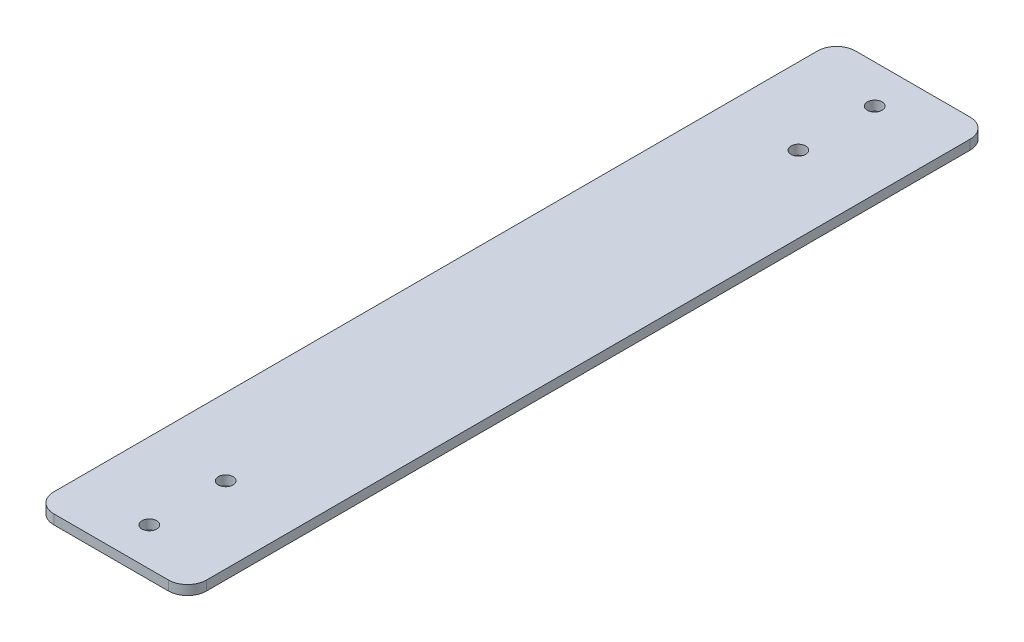
ISO-10303-21;
HEADER;
FILE_DESCRIPTION(('STEP AP214'),'2;1');
FILE_NAME('part.step','',(''),(''),'','','');
FILE_SCHEMA(('AUTOMOTIVE_DESIGN { 1 0 10303 214 1 1 1 1 }'));
ENDSEC;
DATA;
#1=APPLICATION_CONTEXT('core data for automotive mechanical design processes');
#2=APPLICATION_PROTOCOL_DEFINITION('international standard','automotive_design',2000,#1);
#3=PRODUCT_CONTEXT('',#1,'mechanical');
#4=PRODUCT('Part','Part','',(#3));
#5=PRODUCT_RELATED_PRODUCT_CATEGORY('part','',(#4));
#6=PRODUCT_DEFINITION_FORMATION('','',#4);
#7=PRODUCT_DEFINITION_CONTEXT('part definition',#1,'design');
#8=PRODUCT_DEFINITION('design','',#6,#7);
#9=PRODUCT_DEFINITION_SHAPE('','',#8);
#10=(LENGTH_UNIT() NAMED_UNIT(*) SI_UNIT(.MILLI.,.METRE.));
#11=(NAMED_UNIT(*) PLANE_ANGLE_UNIT() SI_UNIT($,.RADIAN.));
#12=(NAMED_UNIT(*) SI_UNIT($,.STERADIAN.) SOLID_ANGLE_UNIT());
#13=UNCERTAINTY_MEASURE_WITH_UNIT(LENGTH_MEASURE(1.E-05),#10,'distance_accuracy_value','');
#14=(GEOMETRIC_REPRESENTATION_CONTEXT(3) GLOBAL_UNCERTAINTY_ASSIGNED_CONTEXT((#13)) GLOBAL_UNIT_ASSIGNED_CONTEXT((#10,
#11,#12)) REPRESENTATION_CONTEXT('',''));
#15=CARTESIAN_POINT('',(0.,0.,0.));
#16=DIRECTION('',(0.,0.,1.));
#17=DIRECTION('',(1.,0.,0.));
#18=AXIS2_PLACEMENT_3D('',#15,#16,#17);
#19=CARTESIAN_POINT('',(-25.4,-3.18262,-133.35));
#20=DIRECTION('',(0.,1.,0.));
#21=DIRECTION('',(0.,0.,1.));
#22=AXIS2_PLACEMENT_3D('',#19,#20,#21);
#23=PLANE('',#22);
#24=CARTESIAN_POINT('',(0.,-3.18262,-120.65));
#25=DIRECTION('',(0.,1.,0.));
#26=DIRECTION('',(0.,0.,1.));
#27=AXIS2_PLACEMENT_3D('',#24,#25,#26);
#28=CIRCLE('',#27,2.4384);
#29=CARTESIAN_POINT('',(0.,-3.18262,-118.2116));
#30=VERTEX_POINT('',#29);
#31=EDGE_CURVE('E140',#30,#30,#28,.T.);
#32=ORIENTED_EDGE('',*,*,#31,.T.);
#33=EDGE_LOOP('',(#32));
#34=FACE_BOUND('',#33,.T.);
#35=CARTESIAN_POINT('',(0.,-3.18262,95.25));
#36=DIRECTION('',(0.,-1.,0.));
#37=DIRECTION('',(0.,0.,-1.));
#38=AXIS2_PLACEMENT_3D('',#35,#36,#37);
#39=CIRCLE('',#38,2.4384);
#40=CARTESIAN_POINT('',(0.,-3.18262,92.8116));
#41=VERTEX_POINT('',#40);
#42=EDGE_CURVE('E143',#41,#41,#39,.F.);
#43=ORIENTED_EDGE('',*,*,#42,.T.);
#44=EDGE_LOOP('',(#43));
#45=FACE_BOUND('',#44,.T.);
#46=CARTESIAN_POINT('',(0.,-3.18262,120.65));
#47=DIRECTION('',(0.,-1.,0.));
#48=DIRECTION('',(0.,0.,-1.));
#49=AXIS2_PLACEMENT_3D('',#46,#47,#48);
#50=CIRCLE('',#49,2.4384);
#51=CARTESIAN_POINT('',(0.,-3.18262,118.2116));
#52=VERTEX_POINT('',#51);
#53=EDGE_CURVE('E146',#52,#52,#50,.F.);
#54=ORIENTED_EDGE('',*,*,#53,.T.);
#55=EDGE_LOOP('',(#54));
#56=FACE_BOUND('',#55,.T.);
#57=CARTESIAN_POINT('',(0.,-3.18262,-95.25));
#58=DIRECTION('',(0.,1.,0.));
#59=DIRECTION('',(0.,0.,1.));
#60=AXIS2_PLACEMENT_3D('',#57,#58,#59);
#61=CIRCLE('',#60,2.4384);
#62=CARTESIAN_POINT('',(0.,-3.18262,-92.8116));
#63=VERTEX_POINT('',#62);
#64=EDGE_CURVE('E149',#63,#63,#61,.T.);
#65=ORIENTED_EDGE('',*,*,#64,.T.);
#66=EDGE_LOOP('',(#65));
#67=FACE_BOUND('',#66,.T.);
#68=CARTESIAN_POINT('',(19.05,-3.18262,127.));
#69=DIRECTION('',(0.,1.,0.));
#70=DIRECTION('',(0.,0.,1.));
#71=AXIS2_PLACEMENT_3D('',#68,#69,#70);
#72=CIRCLE('',#71,6.35);
#73=CARTESIAN_POINT('',(19.05,-3.18262,133.35));
#74=VERTEX_POINT('',#73);
#75=CARTESIAN_POINT('',(25.4,-3.18262,127.));
#76=VERTEX_POINT('',#75);
#77=EDGE_CURVE('E113',#74,#76,#72,.T.);
#78=ORIENTED_EDGE('',*,*,#77,.F.);
#79=DIRECTION('',(1.,0.,0.));
#80=VECTOR('',#79,1.);
#81=CARTESIAN_POINT('',(0.,-3.18262,133.35));
#82=LINE('',#81,#80);
#83=CARTESIAN_POINT('',(-19.05,-3.18262,133.35));
#84=VERTEX_POINT('',#83);
#85=EDGE_CURVE('E114',#84,#74,#82,.T.);
#86=ORIENTED_EDGE('',*,*,#85,.F.);
#87=CARTESIAN_POINT('',(-19.05,-3.18262,127.));
#88=DIRECTION('',(0.,1.,0.));
#89=DIRECTION('',(0.,0.,1.));
#90=AXIS2_PLACEMENT_3D('',#87,#88,#89);
#91=CIRCLE('',#90,6.35);
#92=CARTESIAN_POINT('',(-25.4,-3.18262,127.));
#93=VERTEX_POINT('',#92);
#94=EDGE_CURVE('E88',#93,#84,#91,.T.);
#95=ORIENTED_EDGE('',*,*,#94,.F.);
#96=DIRECTION('',(0.,0.,1.));
#97=VECTOR('',#96,1.);
#98=CARTESIAN_POINT('',(-25.4,-3.18262,0.));
#99=LINE('',#98,#97);
#100=CARTESIAN_POINT('',(-25.4,-3.18262,-127.));
#101=VERTEX_POINT('',#100);
#102=EDGE_CURVE('E83',#101,#93,#99,.T.);
#103=ORIENTED_EDGE('',*,*,#102,.F.);
#104=CARTESIAN_POINT('',(-19.05,-3.18262,-127.));
#105=DIRECTION('',(0.,1.,0.));
#106=DIRECTION('',(0.,0.,1.));
#107=AXIS2_PLACEMENT_3D('',#104,#105,#106);
#108=CIRCLE('',#107,6.35);
#109=CARTESIAN_POINT('',(-19.05,-3.18262,-133.35));
#110=VERTEX_POINT('',#109);
#111=EDGE_CURVE('E20',#110,#101,#108,.T.);
#112=ORIENTED_EDGE('',*,*,#111,.F.);
#113=DIRECTION('',(1.,0.,0.));
#114=VECTOR('',#113,1.);
#115=CARTESIAN_POINT('',(0.,-3.18262,-133.35));
#116=LINE('',#115,#114);
#117=CARTESIAN_POINT('',(19.05,-3.18262,-133.35));
#118=VERTEX_POINT('',#117);
#119=EDGE_CURVE('E78',#110,#118,#116,.T.);
#120=ORIENTED_EDGE('',*,*,#119,.T.);
#121=CARTESIAN_POINT('',(19.05,-3.18262,-127.));
#122=DIRECTION('',(0.,1.,0.));
#123=DIRECTION('',(0.,0.,1.));
#124=AXIS2_PLACEMENT_3D('',#121,#122,#123);
#125=CIRCLE('',#124,6.35);
#126=CARTESIAN_POINT('',(25.4,-3.18262,-127.));
#127=VERTEX_POINT('',#126);
#128=EDGE_CURVE('E153',#127,#118,#125,.T.);
#129=ORIENTED_EDGE('',*,*,#128,.F.);
#130=DIRECTION('',(0.,0.,1.));
#131=VECTOR('',#130,1.);
#132=CARTESIAN_POINT('',(25.4,-3.18262,0.));
#133=LINE('',#132,#131);
#134=EDGE_CURVE('E110',#127,#76,#133,.T.);
#135=ORIENTED_EDGE('',*,*,#134,.T.);
#136=EDGE_LOOP('',(#78,#86,#95,#103,#112,#120,#129,#135));
#137=FACE_BOUND('',#136,.T.);
#138=ADVANCED_FACE('F17',(#34,#45,#56,#67,#137),#23,.F.);
#139=CARTESIAN_POINT('',(0.,-1.59131,-133.35));
#140=DIRECTION('',(0.,0.,1.));
#141=DIRECTION('',(1.,0.,0.));
#142=AXIS2_PLACEMENT_3D('',#139,#140,#141);
#143=PLANE('',#142);
#144=DIRECTION('',(0.,1.,0.));
#145=VECTOR('',#144,1.);
#146=CARTESIAN_POINT('',(-19.05,-11.139941144,-133.35));
#147=LINE('',#146,#145);
#148=CARTESIAN_POINT('',(-19.05,0.,-133.35));
#149=VERTEX_POINT('',#148);
#150=EDGE_CURVE('E98',#149,#110,#147,.F.);
#151=ORIENTED_EDGE('',*,*,#150,.F.);
#152=DIRECTION('',(1.,0.,0.));
#153=VECTOR('',#152,1.);
#154=CARTESIAN_POINT('',(-25.4,0.,-133.35));
#155=LINE('',#154,#153);
#156=CARTESIAN_POINT('',(19.05,0.,-133.35));
#157=VERTEX_POINT('',#156);
#158=EDGE_CURVE('E139',#157,#149,#155,.F.);
#159=ORIENTED_EDGE('',*,*,#158,.F.);
#160=DIRECTION('',(0.,1.,0.));
#161=VECTOR('',#160,1.);
#162=CARTESIAN_POINT('',(19.05,-11.139941144,-133.35));
#163=LINE('',#162,#161);
#164=EDGE_CURVE('E152',#118,#157,#163,.T.);
#165=ORIENTED_EDGE('',*,*,#164,.F.);
#166=ORIENTED_EDGE('',*,*,#119,.F.);
#167=EDGE_LOOP('',(#151,#159,#165,#166));
#168=FACE_BOUND('',#167,.T.);
#169=ADVANCED_FACE('F184',(#168),#143,.F.);
#170=CARTESIAN_POINT('',(-19.05,-11.139941144,-127.));
#171=DIRECTION('',(0.,1.,0.));
#172=DIRECTION('',(0.,0.,1.));
#173=AXIS2_PLACEMENT_3D('',#170,#171,#172);
#174=CYLINDRICAL_SURFACE('',#173,6.35);
#175=DIRECTION('',(0.,1.,0.));
#176=VECTOR('',#175,1.);
#177=CARTESIAN_POINT('',(-25.4,-1.59131,-127.));
#178=LINE('',#177,#176);
#179=CARTESIAN_POINT('',(-25.4,0.,-127.));
#180=VERTEX_POINT('',#179);
#181=EDGE_CURVE('E92',#180,#101,#178,.F.);
#182=ORIENTED_EDGE('',*,*,#181,.F.);
#183=CARTESIAN_POINT('',(-19.05,0.,-127.));
#184=DIRECTION('',(0.,1.,0.));
#185=DIRECTION('',(0.,0.,1.));
#186=AXIS2_PLACEMENT_3D('',#183,#184,#185);
#187=CIRCLE('',#186,6.35);
#188=EDGE_CURVE('E137',#149,#180,#187,.T.);
#189=ORIENTED_EDGE('',*,*,#188,.F.);
#190=ORIENTED_EDGE('',*,*,#150,.T.);
#191=ORIENTED_EDGE('',*,*,#111,.T.);
#192=EDGE_LOOP('',(#182,#189,#190,#191));
#193=FACE_BOUND('',#192,.T.);
#194=ADVANCED_FACE('F95',(#193),#174,.T.);
#195=CARTESIAN_POINT('',(-25.4,-1.59131,0.));
#196=DIRECTION('',(-1.,0.,0.));
#197=DIRECTION('',(0.,0.,1.));
#198=AXIS2_PLACEMENT_3D('',#195,#196,#197);
#199=PLANE('',#198);
#200=DIRECTION('',(0.,0.,1.));
#201=VECTOR('',#200,1.);
#202=CARTESIAN_POINT('',(-25.4,0.,-133.35));
#203=LINE('',#202,#201);
#204=CARTESIAN_POINT('',(-25.4,0.,127.));
#205=VERTEX_POINT('',#204);
#206=EDGE_CURVE('E101',#180,#205,#203,.T.);
#207=ORIENTED_EDGE('',*,*,#206,.F.);
#208=ORIENTED_EDGE('',*,*,#181,.T.);
#209=ORIENTED_EDGE('',*,*,#102,.T.);
#210=DIRECTION('',(0.,1.,0.));
#211=VECTOR('',#210,1.);
#212=CARTESIAN_POINT('',(-25.4,-11.139941144,127.));
#213=LINE('',#212,#211);
#214=EDGE_CURVE('E103',#205,#93,#213,.F.);
#215=ORIENTED_EDGE('',*,*,#214,.F.);
#216=EDGE_LOOP('',(#207,#208,#209,#215));
#217=FACE_BOUND('',#216,.T.);
#218=ADVANCED_FACE('F99',(#217),#199,.T.);
#219=CARTESIAN_POINT('',(-19.05,-11.139941144,127.));
#220=DIRECTION('',(0.,1.,0.));
#221=DIRECTION('',(0.,0.,1.));
#222=AXIS2_PLACEMENT_3D('',#219,#220,#221);
#223=CYLINDRICAL_SURFACE('',#222,6.35);
#224=DIRECTION('',(0.,1.,0.));
#225=VECTOR('',#224,1.);
#226=CARTESIAN_POINT('',(-19.05,-1.59131,133.35));
#227=LINE('',#226,#225);
#228=CARTESIAN_POINT('',(-19.05,0.,133.35));
#229=VERTEX_POINT('',#228);
#230=EDGE_CURVE('E116',#229,#84,#227,.F.);
#231=ORIENTED_EDGE('',*,*,#230,.F.);
#232=CARTESIAN_POINT('',(-19.05,0.,127.));
#233=DIRECTION('',(0.,1.,0.));
#234=DIRECTION('',(0.,0.,1.));
#235=AXIS2_PLACEMENT_3D('',#232,#233,#234);
#236=CIRCLE('',#235,6.35);
#237=EDGE_CURVE('E134',#205,#229,#236,.T.);
#238=ORIENTED_EDGE('',*,*,#237,.F.);
#239=ORIENTED_EDGE('',*,*,#214,.T.);
#240=ORIENTED_EDGE('',*,*,#94,.T.);
#241=EDGE_LOOP('',(#231,#238,#239,#240));
#242=FACE_BOUND('',#241,.T.);
#243=ADVANCED_FACE('F186',(#242),#223,.T.);
#244=CARTESIAN_POINT('',(0.,-1.59131,133.35));
#245=DIRECTION('',(0.,0.,1.));
#246=DIRECTION('',(1.,0.,0.));
#247=AXIS2_PLACEMENT_3D('',#244,#245,#246);
#248=PLANE('',#247);
#249=ORIENTED_EDGE('',*,*,#85,.T.);
#250=DIRECTION('',(0.,1.,0.));
#251=VECTOR('',#250,1.);
#252=CARTESIAN_POINT('',(19.05,-11.139941144,133.35));
#253=LINE('',#252,#251);
#254=CARTESIAN_POINT('',(19.05,0.,133.35));
#255=VERTEX_POINT('',#254);
#256=EDGE_CURVE('E115',#255,#74,#253,.F.);
#257=ORIENTED_EDGE('',*,*,#256,.F.);
#258=DIRECTION('',(1.,0.,0.));
#259=VECTOR('',#258,1.);
#260=CARTESIAN_POINT('',(-25.4,0.,133.35));
#261=LINE('',#260,#259);
#262=EDGE_CURVE('E133',#229,#255,#261,.T.);
#263=ORIENTED_EDGE('',*,*,#262,.F.);
#264=ORIENTED_EDGE('',*,*,#230,.T.);
#265=EDGE_LOOP('',(#249,#257,#263,#264));
#266=FACE_BOUND('',#265,.T.);
#267=ADVANCED_FACE('F187',(#266),#248,.T.);
#268=CARTESIAN_POINT('',(19.05,-11.139941144,127.));
#269=DIRECTION('',(0.,1.,0.));
#270=DIRECTION('',(0.,0.,1.));
#271=AXIS2_PLACEMENT_3D('',#268,#269,#270);
#272=CYLINDRICAL_SURFACE('',#271,6.35);
#273=DIRECTION('',(0.,1.,0.));
#274=VECTOR('',#273,1.);
#275=CARTESIAN_POINT('',(25.4,-1.59131,127.));
#276=LINE('',#275,#274);
#277=CARTESIAN_POINT('',(25.4,0.,127.));
#278=VERTEX_POINT('',#277);
#279=EDGE_CURVE('E112',#76,#278,#276,.T.);
#280=ORIENTED_EDGE('',*,*,#279,.T.);
#281=CARTESIAN_POINT('',(19.05,0.,127.));
#282=DIRECTION('',(0.,1.,0.));
#283=DIRECTION('',(0.,0.,1.));
#284=AXIS2_PLACEMENT_3D('',#281,#282,#283);
#285=CIRCLE('',#284,6.35);
#286=EDGE_CURVE('E130',#255,#278,#285,.T.);
#287=ORIENTED_EDGE('',*,*,#286,.F.);
#288=ORIENTED_EDGE('',*,*,#256,.T.);
#289=ORIENTED_EDGE('',*,*,#77,.T.);
#290=EDGE_LOOP('',(#280,#287,#288,#289));
#291=FACE_BOUND('',#290,.T.);
#292=ADVANCED_FACE('F181',(#291),#272,.T.);
#293=CARTESIAN_POINT('',(25.4,-1.59131,0.));
#294=DIRECTION('',(-1.,0.,0.));
#295=DIRECTION('',(0.,0.,1.));
#296=AXIS2_PLACEMENT_3D('',#293,#294,#295);
#297=PLANE('',#296);
#298=ORIENTED_EDGE('',*,*,#279,.F.);
#299=ORIENTED_EDGE('',*,*,#134,.F.);
#300=DIRECTION('',(0.,1.,0.));
#301=VECTOR('',#300,1.);
#302=CARTESIAN_POINT('',(25.4,-11.139941144,-127.));
#303=LINE('',#302,#301);
#304=CARTESIAN_POINT('',(25.4,0.,-127.));
#305=VERTEX_POINT('',#304);
#306=EDGE_CURVE('E35',#305,#127,#303,.F.);
#307=ORIENTED_EDGE('',*,*,#306,.F.);
#308=DIRECTION('',(0.,0.,1.));
#309=VECTOR('',#308,1.);
#310=CARTESIAN_POINT('',(25.4,0.,-133.35));
#311=LINE('',#310,#309);
#312=EDGE_CURVE('E129',#278,#305,#311,.F.);
#313=ORIENTED_EDGE('',*,*,#312,.F.);
#314=EDGE_LOOP('',(#298,#299,#307,#313));
#315=FACE_BOUND('',#314,.T.);
#316=ADVANCED_FACE('F178',(#315),#297,.F.);
#317=CARTESIAN_POINT('',(19.05,-11.139941144,-127.));
#318=DIRECTION('',(0.,1.,0.));
#319=DIRECTION('',(0.,0.,1.));
#320=AXIS2_PLACEMENT_3D('',#317,#318,#319);
#321=CYLINDRICAL_SURFACE('',#320,6.35);
#322=ORIENTED_EDGE('',*,*,#164,.T.);
#323=CARTESIAN_POINT('',(19.05,0.,-127.));
#324=DIRECTION('',(0.,1.,0.));
#325=DIRECTION('',(0.,0.,1.));
#326=AXIS2_PLACEMENT_3D('',#323,#324,#325);
#327=CIRCLE('',#326,6.35);
#328=EDGE_CURVE('E126',#305,#157,#327,.T.);
#329=ORIENTED_EDGE('',*,*,#328,.F.);
#330=ORIENTED_EDGE('',*,*,#306,.T.);
#331=ORIENTED_EDGE('',*,*,#128,.T.);
#332=EDGE_LOOP('',(#322,#329,#330,#331));
#333=FACE_BOUND('',#332,.T.);
#334=ADVANCED_FACE('F183',(#333),#321,.T.);
#335=CARTESIAN_POINT('',(0.,-3.18262,-95.25));
#336=DIRECTION('',(0.,1.,0.));
#337=DIRECTION('',(0.,0.,1.));
#338=AXIS2_PLACEMENT_3D('',#335,#336,#337);
#339=CYLINDRICAL_SURFACE('',#338,2.4384);
#340=ORIENTED_EDGE('',*,*,#64,.F.);
#341=EDGE_LOOP('',(#340));
#342=FACE_BOUND('',#341,.T.);
#343=CARTESIAN_POINT('',(0.,0.,-95.25));
#344=DIRECTION('',(0.,1.,0.));
#345=DIRECTION('',(0.,0.,1.));
#346=AXIS2_PLACEMENT_3D('',#343,#344,#345);
#347=CIRCLE('',#346,2.4384);
#348=CARTESIAN_POINT('',(0.,0.,-92.8116));
#349=VERTEX_POINT('',#348);
#350=EDGE_CURVE('E123',#349,#349,#347,.F.);
#351=ORIENTED_EDGE('',*,*,#350,.F.);
#352=EDGE_LOOP('',(#351));
#353=FACE_BOUND('',#352,.T.);
#354=ADVANCED_FACE('F215',(#342,#353),#339,.F.);
#355=CARTESIAN_POINT('',(0.,-3.18262,120.65));
#356=DIRECTION('',(0.,-1.,0.));
#357=DIRECTION('',(0.,0.,-1.));
#358=AXIS2_PLACEMENT_3D('',#355,#356,#357);
#359=CYLINDRICAL_SURFACE('',#358,2.4384);
#360=CARTESIAN_POINT('',(0.,0.,120.65));
#361=DIRECTION('',(0.,-1.,0.));
#362=DIRECTION('',(0.,0.,-1.));
#363=AXIS2_PLACEMENT_3D('',#360,#361,#362);
#364=CIRCLE('',#363,2.4384);
#365=CARTESIAN_POINT('',(0.,0.,118.2116));
#366=VERTEX_POINT('',#365);
#367=EDGE_CURVE('E120',#366,#366,#364,.T.);
#368=ORIENTED_EDGE('',*,*,#367,.F.);
#369=EDGE_LOOP('',(#368));
#370=FACE_BOUND('',#369,.T.);
#371=ORIENTED_EDGE('',*,*,#53,.F.);
#372=EDGE_LOOP('',(#371));
#373=FACE_BOUND('',#372,.T.);
#374=ADVANCED_FACE('F211',(#370,#373),#359,.F.);
#375=CARTESIAN_POINT('',(0.,-3.18262,95.25));
#376=DIRECTION('',(0.,-1.,0.));
#377=DIRECTION('',(0.,0.,-1.));
#378=AXIS2_PLACEMENT_3D('',#375,#376,#377);
#379=CYLINDRICAL_SURFACE('',#378,2.4384);
#380=CARTESIAN_POINT('',(0.,0.,95.25));
#381=DIRECTION('',(0.,-1.,0.));
#382=DIRECTION('',(0.,0.,-1.));
#383=AXIS2_PLACEMENT_3D('',#380,#381,#382);
#384=CIRCLE('',#383,2.4384);
#385=CARTESIAN_POINT('',(0.,0.,92.8116));
#386=VERTEX_POINT('',#385);
#387=EDGE_CURVE('E26',#386,#386,#384,.T.);
#388=ORIENTED_EDGE('',*,*,#387,.F.);
#389=EDGE_LOOP('',(#388));
#390=FACE_BOUND('',#389,.T.);
#391=ORIENTED_EDGE('',*,*,#42,.F.);
#392=EDGE_LOOP('',(#391));
#393=FACE_BOUND('',#392,.T.);
#394=ADVANCED_FACE('F204',(#390,#393),#379,.F.);
#395=CARTESIAN_POINT('',(0.,-3.18262,-120.65));
#396=DIRECTION('',(0.,1.,0.));
#397=DIRECTION('',(0.,0.,1.));
#398=AXIS2_PLACEMENT_3D('',#395,#396,#397);
#399=CYLINDRICAL_SURFACE('',#398,2.4384);
#400=ORIENTED_EDGE('',*,*,#31,.F.);
#401=EDGE_LOOP('',(#400));
#402=FACE_BOUND('',#401,.T.);
#403=CARTESIAN_POINT('',(0.,0.,-120.65));
#404=DIRECTION('',(0.,1.,0.));
#405=DIRECTION('',(0.,0.,1.));
#406=AXIS2_PLACEMENT_3D('',#403,#404,#405);
#407=CIRCLE('',#406,2.4384);
#408=CARTESIAN_POINT('',(0.,0.,-118.2116));
#409=VERTEX_POINT('',#408);
#410=EDGE_CURVE('E11',#409,#409,#407,.F.);
#411=ORIENTED_EDGE('',*,*,#410,.F.);
#412=EDGE_LOOP('',(#411));
#413=FACE_BOUND('',#412,.T.);
#414=ADVANCED_FACE('F198',(#402,#413),#399,.F.);
#415=CARTESIAN_POINT('',(-25.4,0.,-133.35));
#416=DIRECTION('',(0.,1.,0.));
#417=DIRECTION('',(0.,0.,1.));
#418=AXIS2_PLACEMENT_3D('',#415,#416,#417);
#419=PLANE('',#418);
#420=ORIENTED_EDGE('',*,*,#410,.T.);
#421=EDGE_LOOP('',(#420));
#422=FACE_BOUND('',#421,.T.);
#423=ORIENTED_EDGE('',*,*,#387,.T.);
#424=EDGE_LOOP('',(#423));
#425=FACE_BOUND('',#424,.T.);
#426=ORIENTED_EDGE('',*,*,#367,.T.);
#427=EDGE_LOOP('',(#426));
#428=FACE_BOUND('',#427,.T.);
#429=ORIENTED_EDGE('',*,*,#350,.T.);
#430=EDGE_LOOP('',(#429));
#431=FACE_BOUND('',#430,.T.);
#432=ORIENTED_EDGE('',*,*,#312,.T.);
#433=ORIENTED_EDGE('',*,*,#328,.T.);
#434=ORIENTED_EDGE('',*,*,#158,.T.);
#435=ORIENTED_EDGE('',*,*,#188,.T.);
#436=ORIENTED_EDGE('',*,*,#206,.T.);
#437=ORIENTED_EDGE('',*,*,#237,.T.);
#438=ORIENTED_EDGE('',*,*,#262,.T.);
#439=ORIENTED_EDGE('',*,*,#286,.T.);
#440=EDGE_LOOP('',(#432,#433,#434,#435,#436,#437,#438,#439));
#441=FACE_BOUND('',#440,.T.);
#442=ADVANCED_FACE('F175',(#422,#425,#428,#431,#441),#419,.T.);
#443=CLOSED_SHELL('',(#138,#169,#194,#218,#243,#267,#292,#316,#334,#354,#374,#394,#414,#442));
#444=MANIFOLD_SOLID_BREP('B1',#443);
#445=ADVANCED_BREP_SHAPE_REPRESENTATION('',(#18,#444),#14);
#446=SHAPE_DEFINITION_REPRESENTATION(#9,#445);
ENDSEC;
END-ISO-10303-21;
